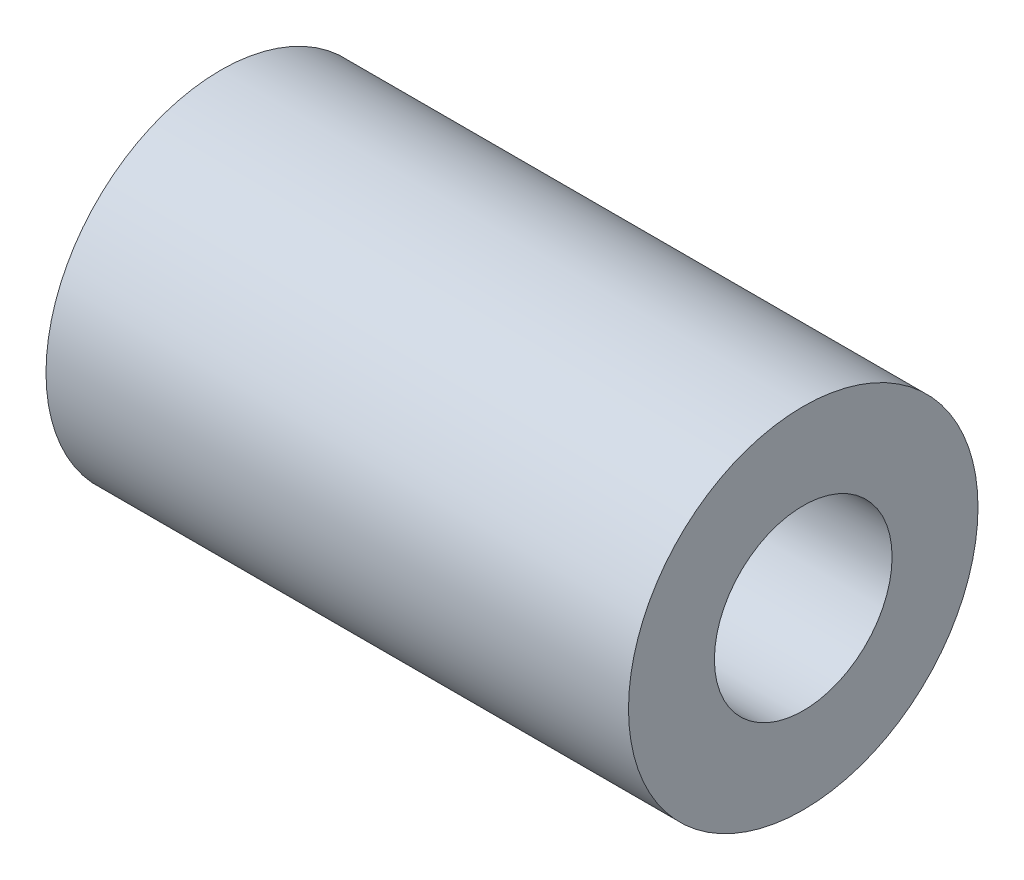
ISO-10303-21;
HEADER;
FILE_DESCRIPTION(('STEP AP214'),'2;1');
FILE_NAME('part.step','',(''),(''),'','','');
FILE_SCHEMA(('AUTOMOTIVE_DESIGN { 1 0 10303 214 1 1 1 1 }'));
ENDSEC;
DATA;
#1=APPLICATION_CONTEXT('core data for automotive mechanical design processes');
#2=APPLICATION_PROTOCOL_DEFINITION('international standard','automotive_design',2000,#1);
#3=PRODUCT_CONTEXT('',#1,'mechanical');
#4=PRODUCT('Part','Part','',(#3));
#5=PRODUCT_RELATED_PRODUCT_CATEGORY('part','',(#4));
#6=PRODUCT_DEFINITION_FORMATION('','',#4);
#7=PRODUCT_DEFINITION_CONTEXT('part definition',#1,'design');
#8=PRODUCT_DEFINITION('design','',#6,#7);
#9=PRODUCT_DEFINITION_SHAPE('','',#8);
#10=(LENGTH_UNIT() NAMED_UNIT(*) SI_UNIT(.MILLI.,.METRE.));
#11=(NAMED_UNIT(*) PLANE_ANGLE_UNIT() SI_UNIT($,.RADIAN.));
#12=(NAMED_UNIT(*) SI_UNIT($,.STERADIAN.) SOLID_ANGLE_UNIT());
#13=UNCERTAINTY_MEASURE_WITH_UNIT(LENGTH_MEASURE(1.E-05),#10,'distance_accuracy_value','');
#14=(GEOMETRIC_REPRESENTATION_CONTEXT(3) GLOBAL_UNCERTAINTY_ASSIGNED_CONTEXT((#13)) GLOBAL_UNIT_ASSIGNED_CONTEXT((#10,
#11,#12)) REPRESENTATION_CONTEXT('',''));
#15=CARTESIAN_POINT('',(0.,0.,0.));
#16=DIRECTION('',(0.,0.,1.));
#17=DIRECTION('',(1.,0.,0.));
#18=AXIS2_PLACEMENT_3D('',#15,#16,#17);
#19=CARTESIAN_POINT('',(10.,0.,0.));
#20=DIRECTION('',(1.,0.,0.));
#21=DIRECTION('',(0.,0.,-1.));
#22=AXIS2_PLACEMENT_3D('',#19,#20,#21);
#23=PLANE('',#22);
#24=CARTESIAN_POINT('',(10.,0.,0.));
#25=DIRECTION('',(1.,0.,0.));
#26=DIRECTION('',(0.,0.,-1.));
#27=AXIS2_PLACEMENT_3D('',#24,#25,#26);
#28=CIRCLE('',#27,6.);
#29=CARTESIAN_POINT('',(10.,0.,-6.));
#30=VERTEX_POINT('',#29);
#31=EDGE_CURVE('E10',#30,#30,#28,.T.);
#32=ORIENTED_EDGE('',*,*,#31,.T.);
#33=EDGE_LOOP('',(#32));
#34=FACE_BOUND('',#33,.T.);
#35=CARTESIAN_POINT('',(10.,0.,0.));
#36=DIRECTION('',(1.,0.,0.));
#37=DIRECTION('',(0.,0.,-1.));
#38=AXIS2_PLACEMENT_3D('',#35,#36,#37);
#39=CIRCLE('',#38,3.05);
#40=CARTESIAN_POINT('',(10.,0.,-3.05));
#41=VERTEX_POINT('',#40);
#42=EDGE_CURVE('E35',#41,#41,#39,.T.);
#43=ORIENTED_EDGE('',*,*,#42,.F.);
#44=EDGE_LOOP('',(#43));
#45=FACE_BOUND('',#44,.T.);
#46=ADVANCED_FACE('F24',(#34,#45),#23,.T.);
#47=CARTESIAN_POINT('',(-10.,0.,0.));
#48=DIRECTION('',(1.,0.,0.));
#49=DIRECTION('',(0.,0.,-1.));
#50=AXIS2_PLACEMENT_3D('',#47,#48,#49);
#51=PLANE('',#50);
#52=CARTESIAN_POINT('',(-10.,0.,0.));
#53=DIRECTION('',(1.,0.,0.));
#54=DIRECTION('',(0.,0.,-1.));
#55=AXIS2_PLACEMENT_3D('',#52,#53,#54);
#56=CIRCLE('',#55,6.);
#57=CARTESIAN_POINT('',(-10.,0.,-6.));
#58=VERTEX_POINT('',#57);
#59=EDGE_CURVE('E31',#58,#58,#56,.T.);
#60=ORIENTED_EDGE('',*,*,#59,.F.);
#61=EDGE_LOOP('',(#60));
#62=FACE_BOUND('',#61,.T.);
#63=CARTESIAN_POINT('',(-10.,0.,0.));
#64=DIRECTION('',(1.,0.,0.));
#65=DIRECTION('',(0.,0.,-1.));
#66=AXIS2_PLACEMENT_3D('',#63,#64,#65);
#67=CIRCLE('',#66,3.05);
#68=CARTESIAN_POINT('',(-10.,0.,-3.05));
#69=VERTEX_POINT('',#68);
#70=EDGE_CURVE('E39',#69,#69,#67,.T.);
#71=ORIENTED_EDGE('',*,*,#70,.T.);
#72=EDGE_LOOP('',(#71));
#73=FACE_BOUND('',#72,.T.);
#74=ADVANCED_FACE('F45',(#62,#73),#51,.F.);
#75=CARTESIAN_POINT('',(10.,0.,0.));
#76=DIRECTION('',(-1.,0.,0.));
#77=DIRECTION('',(0.,0.,1.));
#78=AXIS2_PLACEMENT_3D('',#75,#76,#77);
#79=CYLINDRICAL_SURFACE('',#78,6.);
#80=ORIENTED_EDGE('',*,*,#31,.F.);
#81=EDGE_LOOP('',(#80));
#82=FACE_BOUND('',#81,.T.);
#83=ORIENTED_EDGE('',*,*,#59,.T.);
#84=EDGE_LOOP('',(#83));
#85=FACE_BOUND('',#84,.T.);
#86=ADVANCED_FACE('F26',(#82,#85),#79,.T.);
#87=CARTESIAN_POINT('',(10.,0.,0.));
#88=DIRECTION('',(-1.,0.,0.));
#89=DIRECTION('',(0.,0.,1.));
#90=AXIS2_PLACEMENT_3D('',#87,#88,#89);
#91=CYLINDRICAL_SURFACE('',#90,3.05);
#92=ORIENTED_EDGE('',*,*,#42,.T.);
#93=EDGE_LOOP('',(#92));
#94=FACE_BOUND('',#93,.T.);
#95=ORIENTED_EDGE('',*,*,#70,.F.);
#96=EDGE_LOOP('',(#95));
#97=FACE_BOUND('',#96,.T.);
#98=ADVANCED_FACE('F47',(#94,#97),#91,.F.);
#99=CLOSED_SHELL('',(#46,#74,#86,#98));
#100=MANIFOLD_SOLID_BREP('B2',#99);
#101=ADVANCED_BREP_SHAPE_REPRESENTATION('',(#18,#100),#14);
#102=SHAPE_DEFINITION_REPRESENTATION(#9,#101);
ENDSEC;
END-ISO-10303-21;
